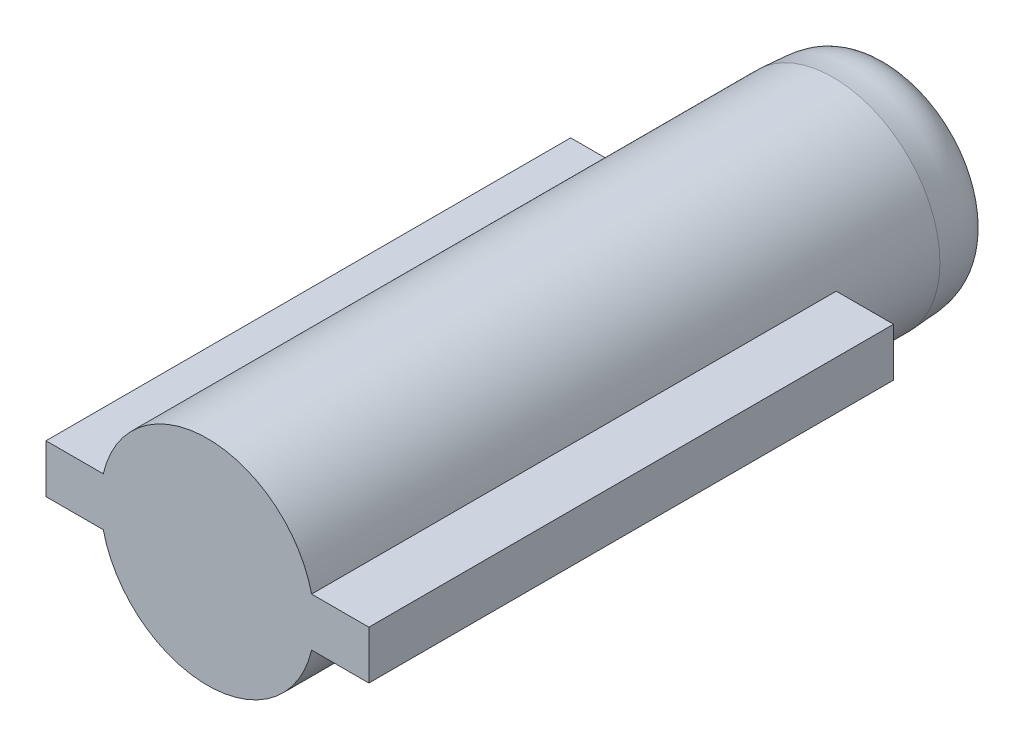
ISO-10303-21;
HEADER;
FILE_DESCRIPTION(('STEP AP214'),'2;1');
FILE_NAME('part.step','',(''),(''),'','','');
FILE_SCHEMA(('AUTOMOTIVE_DESIGN { 1 0 10303 214 1 1 1 1 }'));
ENDSEC;
DATA;
#1=APPLICATION_CONTEXT('core data for automotive mechanical design processes');
#2=APPLICATION_PROTOCOL_DEFINITION('international standard','automotive_design',2000,#1);
#3=PRODUCT_CONTEXT('',#1,'mechanical');
#4=PRODUCT('Part','Part','',(#3));
#5=PRODUCT_RELATED_PRODUCT_CATEGORY('part','',(#4));
#6=PRODUCT_DEFINITION_FORMATION('','',#4);
#7=PRODUCT_DEFINITION_CONTEXT('part definition',#1,'design');
#8=PRODUCT_DEFINITION('design','',#6,#7);
#9=PRODUCT_DEFINITION_SHAPE('','',#8);
#10=(LENGTH_UNIT() NAMED_UNIT(*) SI_UNIT(.MILLI.,.METRE.));
#11=(NAMED_UNIT(*) PLANE_ANGLE_UNIT() SI_UNIT($,.RADIAN.));
#12=(NAMED_UNIT(*) SI_UNIT($,.STERADIAN.) SOLID_ANGLE_UNIT());
#13=UNCERTAINTY_MEASURE_WITH_UNIT(LENGTH_MEASURE(1.E-05),#10,'distance_accuracy_value','');
#14=(GEOMETRIC_REPRESENTATION_CONTEXT(3) GLOBAL_UNCERTAINTY_ASSIGNED_CONTEXT((#13)) GLOBAL_UNIT_ASSIGNED_CONTEXT((#10,
#11,#12)) REPRESENTATION_CONTEXT('',''));
#15=CARTESIAN_POINT('',(0.,0.,0.));
#16=DIRECTION('',(0.,0.,1.));
#17=DIRECTION('',(1.,0.,0.));
#18=AXIS2_PLACEMENT_3D('',#15,#16,#17);
#19=CARTESIAN_POINT('',(0.,0.,17.));
#20=DIRECTION('',(0.,0.,-1.));
#21=DIRECTION('',(-1.,0.,0.));
#22=AXIS2_PLACEMENT_3D('',#19,#20,#21);
#23=CYLINDRICAL_SURFACE('',#22,2.65);
#24=CARTESIAN_POINT('',(0.,0.,1.50000000000001));
#25=DIRECTION('',(0.,0.,-1.));
#26=DIRECTION('',(-1.,0.,0.));
#27=AXIS2_PLACEMENT_3D('',#24,#25,#26);
#28=CIRCLE('',#27,2.65);
#29=CARTESIAN_POINT('',(-2.65,0.,1.50000000000001));
#30=VERTEX_POINT('',#29);
#31=EDGE_CURVE('E195',#30,#30,#28,.T.);
#32=ORIENTED_EDGE('',*,*,#31,.F.);
#33=EDGE_LOOP('',(#32));
#34=FACE_BOUND('',#33,.T.);
#35=CARTESIAN_POINT('',(0.,0.,4.));
#36=DIRECTION('',(0.,0.,1.));
#37=DIRECTION('',(1.,0.,0.));
#38=AXIS2_PLACEMENT_3D('',#35,#36,#37);
#39=CIRCLE('',#38,2.65);
#40=CARTESIAN_POINT('',(-2.58118189982806,0.6,4.));
#41=VERTEX_POINT('',#40);
#42=CARTESIAN_POINT('',(-2.58118189982806,-0.6,4.));
#43=VERTEX_POINT('',#42);
#44=EDGE_CURVE('E11',#41,#43,#39,.T.);
#45=ORIENTED_EDGE('',*,*,#44,.F.);
#46=DIRECTION('',(0.,0.,-1.));
#47=VECTOR('',#46,1.);
#48=CARTESIAN_POINT('',(-2.58118189982806,0.6,17.));
#49=LINE('',#48,#47);
#50=CARTESIAN_POINT('',(-2.58118189982806,0.6,17.));
#51=VERTEX_POINT('',#50);
#52=EDGE_CURVE('E150',#41,#51,#49,.F.);
#53=ORIENTED_EDGE('',*,*,#52,.T.);
#54=CARTESIAN_POINT('',(0.,0.,17.));
#55=DIRECTION('',(0.,0.,1.));
#56=DIRECTION('',(1.,0.,0.));
#57=AXIS2_PLACEMENT_3D('',#54,#55,#56);
#58=CIRCLE('',#57,2.65);
#59=CARTESIAN_POINT('',(2.58118189982806,0.6,17.));
#60=VERTEX_POINT('',#59);
#61=EDGE_CURVE('E156',#60,#51,#58,.T.);
#62=ORIENTED_EDGE('',*,*,#61,.F.);
#63=DIRECTION('',(0.,0.,-1.));
#64=VECTOR('',#63,1.);
#65=CARTESIAN_POINT('',(2.58118189982806,0.6,17.));
#66=LINE('',#65,#64);
#67=CARTESIAN_POINT('',(2.58118189982806,0.6,4.));
#68=VERTEX_POINT('',#67);
#69=EDGE_CURVE('E153',#60,#68,#66,.T.);
#70=ORIENTED_EDGE('',*,*,#69,.T.);
#71=CARTESIAN_POINT('',(2.58118189982806,-0.6,4.));
#72=VERTEX_POINT('',#71);
#73=EDGE_CURVE('E36',#72,#68,#39,.T.);
#74=ORIENTED_EDGE('',*,*,#73,.F.);
#75=DIRECTION('',(0.,0.,-1.));
#76=VECTOR('',#75,1.);
#77=CARTESIAN_POINT('',(2.58118189982806,-0.599999999999999,17.));
#78=LINE('',#77,#76);
#79=CARTESIAN_POINT('',(2.58118189982806,-0.6,17.));
#80=VERTEX_POINT('',#79);
#81=EDGE_CURVE('E141',#72,#80,#78,.F.);
#82=ORIENTED_EDGE('',*,*,#81,.T.);
#83=CARTESIAN_POINT('',(-2.58118189982806,-0.6,17.));
#84=VERTEX_POINT('',#83);
#85=EDGE_CURVE('E155',#84,#80,#58,.T.);
#86=ORIENTED_EDGE('',*,*,#85,.F.);
#87=DIRECTION('',(0.,0.,-1.));
#88=VECTOR('',#87,1.);
#89=CARTESIAN_POINT('',(-2.58118189982806,-0.6,17.));
#90=LINE('',#89,#88);
#91=EDGE_CURVE('E148',#84,#43,#90,.T.);
#92=ORIENTED_EDGE('',*,*,#91,.T.);
#93=EDGE_LOOP('',(#45,#53,#62,#70,#74,#82,#86,#92));
#94=FACE_BOUND('',#93,.T.);
#95=ADVANCED_FACE('F33',(#34,#94),#23,.T.);
#96=CARTESIAN_POINT('',(0.,0.,17.));
#97=DIRECTION('',(0.,0.,1.));
#98=DIRECTION('',(1.,0.,0.));
#99=AXIS2_PLACEMENT_3D('',#96,#97,#98);
#100=PLANE('',#99);
#101=ORIENTED_EDGE('',*,*,#85,.T.);
#102=DIRECTION('',(1.,0.,0.));
#103=VECTOR('',#102,1.);
#104=CARTESIAN_POINT('',(4.,-0.599999999999999,17.));
#105=LINE('',#104,#103);
#106=CARTESIAN_POINT('',(4.,-0.599999999999999,17.));
#107=VERTEX_POINT('',#106);
#108=EDGE_CURVE('E136',#80,#107,#105,.T.);
#109=ORIENTED_EDGE('',*,*,#108,.T.);
#110=DIRECTION('',(0.,1.,0.));
#111=VECTOR('',#110,1.);
#112=CARTESIAN_POINT('',(4.,-0.599999999999999,17.));
#113=LINE('',#112,#111);
#114=CARTESIAN_POINT('',(4.,0.600000000000001,17.));
#115=VERTEX_POINT('',#114);
#116=EDGE_CURVE('E138',#107,#115,#113,.T.);
#117=ORIENTED_EDGE('',*,*,#116,.T.);
#118=DIRECTION('',(-1.,0.,0.));
#119=VECTOR('',#118,1.);
#120=CARTESIAN_POINT('',(4.,0.600000000000001,17.));
#121=LINE('',#120,#119);
#122=EDGE_CURVE('E54',#115,#60,#121,.T.);
#123=ORIENTED_EDGE('',*,*,#122,.T.);
#124=ORIENTED_EDGE('',*,*,#61,.T.);
#125=CARTESIAN_POINT('',(-4.,0.6,17.));
#126=VERTEX_POINT('',#125);
#127=EDGE_CURVE('E123',#51,#126,#121,.T.);
#128=ORIENTED_EDGE('',*,*,#127,.T.);
#129=DIRECTION('',(0.,-1.,0.));
#130=VECTOR('',#129,1.);
#131=CARTESIAN_POINT('',(-4.,-0.6,17.));
#132=LINE('',#131,#130);
#133=CARTESIAN_POINT('',(-4.,-0.6,17.));
#134=VERTEX_POINT('',#133);
#135=EDGE_CURVE('E134',#126,#134,#132,.T.);
#136=ORIENTED_EDGE('',*,*,#135,.T.);
#137=EDGE_CURVE('E47',#134,#84,#105,.T.);
#138=ORIENTED_EDGE('',*,*,#137,.T.);
#139=EDGE_LOOP('',(#101,#109,#117,#123,#124,#128,#136,#138));
#140=FACE_BOUND('',#139,.T.);
#141=ADVANCED_FACE('F159',(#140),#100,.T.);
#142=CARTESIAN_POINT('',(4.,-0.599999999999999,4.));
#143=DIRECTION('',(1.,0.,0.));
#144=DIRECTION('',(0.,0.,-1.));
#145=AXIS2_PLACEMENT_3D('',#142,#143,#144);
#146=PLANE('',#145);
#147=ORIENTED_EDGE('',*,*,#116,.F.);
#148=DIRECTION('',(0.,0.,1.));
#149=VECTOR('',#148,1.);
#150=CARTESIAN_POINT('',(4.,-0.599999999999999,4.));
#151=LINE('',#150,#149);
#152=CARTESIAN_POINT('',(4.,-0.599999999999999,4.));
#153=VERTEX_POINT('',#152);
#154=EDGE_CURVE('E106',#153,#107,#151,.T.);
#155=ORIENTED_EDGE('',*,*,#154,.F.);
#156=DIRECTION('',(0.,1.,0.));
#157=VECTOR('',#156,1.);
#158=CARTESIAN_POINT('',(4.,-0.599999999999999,4.));
#159=LINE('',#158,#157);
#160=CARTESIAN_POINT('',(4.,0.600000000000001,4.));
#161=VERTEX_POINT('',#160);
#162=EDGE_CURVE('E115',#153,#161,#159,.T.);
#163=ORIENTED_EDGE('',*,*,#162,.T.);
#164=DIRECTION('',(0.,0.,1.));
#165=VECTOR('',#164,1.);
#166=CARTESIAN_POINT('',(4.,0.600000000000001,4.));
#167=LINE('',#166,#165);
#168=EDGE_CURVE('E142',#161,#115,#167,.T.);
#169=ORIENTED_EDGE('',*,*,#168,.T.);
#170=EDGE_LOOP('',(#147,#155,#163,#169));
#171=FACE_BOUND('',#170,.T.);
#172=ADVANCED_FACE('F172',(#171),#146,.T.);
#173=CARTESIAN_POINT('',(0.,0.,4.));
#174=DIRECTION('',(0.,0.,1.));
#175=DIRECTION('',(1.,0.,0.));
#176=AXIS2_PLACEMENT_3D('',#173,#174,#175);
#177=PLANE('',#176);
#178=DIRECTION('',(1.,0.,0.));
#179=VECTOR('',#178,1.);
#180=CARTESIAN_POINT('',(4.,-0.599999999999999,4.));
#181=LINE('',#180,#179);
#182=EDGE_CURVE('E116',#72,#153,#181,.T.);
#183=ORIENTED_EDGE('',*,*,#182,.F.);
#184=ORIENTED_EDGE('',*,*,#73,.T.);
#185=DIRECTION('',(-1.,0.,0.));
#186=VECTOR('',#185,1.);
#187=CARTESIAN_POINT('',(4.,0.600000000000001,4.));
#188=LINE('',#187,#186);
#189=EDGE_CURVE('E107',#161,#68,#188,.T.);
#190=ORIENTED_EDGE('',*,*,#189,.F.);
#191=ORIENTED_EDGE('',*,*,#162,.F.);
#192=EDGE_LOOP('',(#183,#184,#190,#191));
#193=FACE_BOUND('',#192,.T.);
#194=ADVANCED_FACE('F168',(#193),#177,.F.);
#195=CARTESIAN_POINT('',(4.,-0.599999999999999,4.));
#196=DIRECTION('',(0.,-1.,0.));
#197=DIRECTION('',(1.,0.,0.));
#198=AXIS2_PLACEMENT_3D('',#195,#196,#197);
#199=PLANE('',#198);
#200=ORIENTED_EDGE('',*,*,#81,.F.);
#201=ORIENTED_EDGE('',*,*,#182,.T.);
#202=ORIENTED_EDGE('',*,*,#154,.T.);
#203=ORIENTED_EDGE('',*,*,#108,.F.);
#204=EDGE_LOOP('',(#200,#201,#202,#203));
#205=FACE_BOUND('',#204,.T.);
#206=ADVANCED_FACE('F164',(#205),#199,.T.);
#207=CARTESIAN_POINT('',(4.,0.600000000000001,4.));
#208=DIRECTION('',(0.,1.,0.));
#209=DIRECTION('',(-1.,0.,0.));
#210=AXIS2_PLACEMENT_3D('',#207,#208,#209);
#211=PLANE('',#210);
#212=ORIENTED_EDGE('',*,*,#69,.F.);
#213=ORIENTED_EDGE('',*,*,#122,.F.);
#214=ORIENTED_EDGE('',*,*,#168,.F.);
#215=ORIENTED_EDGE('',*,*,#189,.T.);
#216=EDGE_LOOP('',(#212,#213,#214,#215));
#217=FACE_BOUND('',#216,.T.);
#218=ADVANCED_FACE('F174',(#217),#211,.T.);
#219=CARTESIAN_POINT('',(-4.,0.6,4.));
#220=VERTEX_POINT('',#219);
#221=EDGE_CURVE('E131',#41,#220,#188,.T.);
#222=ORIENTED_EDGE('',*,*,#221,.F.);
#223=ORIENTED_EDGE('',*,*,#44,.T.);
#224=CARTESIAN_POINT('',(-4.,-0.6,4.));
#225=VERTEX_POINT('',#224);
#226=EDGE_CURVE('E101',#225,#43,#181,.T.);
#227=ORIENTED_EDGE('',*,*,#226,.F.);
#228=DIRECTION('',(0.,-1.,0.));
#229=VECTOR('',#228,1.);
#230=CARTESIAN_POINT('',(-4.,-0.6,4.));
#231=LINE('',#230,#229);
#232=EDGE_CURVE('E113',#220,#225,#231,.T.);
#233=ORIENTED_EDGE('',*,*,#232,.F.);
#234=EDGE_LOOP('',(#222,#223,#227,#233));
#235=FACE_BOUND('',#234,.T.);
#236=ADVANCED_FACE('F112',(#235),#177,.F.);
#237=ORIENTED_EDGE('',*,*,#52,.F.);
#238=ORIENTED_EDGE('',*,*,#221,.T.);
#239=DIRECTION('',(0.,0.,1.));
#240=VECTOR('',#239,1.);
#241=CARTESIAN_POINT('',(-4.,0.6,4.));
#242=LINE('',#241,#240);
#243=EDGE_CURVE('E121',#220,#126,#242,.T.);
#244=ORIENTED_EDGE('',*,*,#243,.T.);
#245=ORIENTED_EDGE('',*,*,#127,.F.);
#246=EDGE_LOOP('',(#237,#238,#244,#245));
#247=FACE_BOUND('',#246,.T.);
#248=ADVANCED_FACE('F176',(#247),#211,.T.);
#249=ORIENTED_EDGE('',*,*,#91,.F.);
#250=ORIENTED_EDGE('',*,*,#137,.F.);
#251=DIRECTION('',(0.,0.,1.));
#252=VECTOR('',#251,1.);
#253=CARTESIAN_POINT('',(-4.,-0.6,4.));
#254=LINE('',#253,#252);
#255=EDGE_CURVE('E98',#225,#134,#254,.T.);
#256=ORIENTED_EDGE('',*,*,#255,.F.);
#257=ORIENTED_EDGE('',*,*,#226,.T.);
#258=EDGE_LOOP('',(#249,#250,#256,#257));
#259=FACE_BOUND('',#258,.T.);
#260=ADVANCED_FACE('F100',(#259),#199,.T.);
#261=CARTESIAN_POINT('',(-4.,-0.6,4.));
#262=DIRECTION('',(-1.,0.,0.));
#263=DIRECTION('',(0.,0.,1.));
#264=AXIS2_PLACEMENT_3D('',#261,#262,#263);
#265=PLANE('',#264);
#266=ORIENTED_EDGE('',*,*,#135,.F.);
#267=ORIENTED_EDGE('',*,*,#243,.F.);
#268=ORIENTED_EDGE('',*,*,#232,.T.);
#269=ORIENTED_EDGE('',*,*,#255,.T.);
#270=EDGE_LOOP('',(#266,#267,#268,#269));
#271=FACE_BOUND('',#270,.T.);
#272=ADVANCED_FACE('F119',(#271),#265,.T.);
#273=CARTESIAN_POINT('',(0.,2.65,1.50000000000001));
#274=CARTESIAN_POINT('',(0.,2.55537317860218,0.922815805737262));
#275=CARTESIAN_POINT('',(0.,2.84655662610956,-0.00317399949750963));
#276=CARTESIAN_POINT('',(0.,1.43187539710622,0.));
#277=B_SPLINE_CURVE_WITH_KNOTS('',3,(#273,#274,#275,#276),.UNSPECIFIED.,.F.,.F.,(4,4),(0.,
0.91074495904114),.UNSPECIFIED.);
#278=CARTESIAN_POINT('',(0.,0.,0.));
#279=DIRECTION('',(0.,0.,-1.));
#280=AXIS1_PLACEMENT('',#278,#279);
#281=SURFACE_OF_REVOLUTION('',#277,#280);
#282=CARTESIAN_POINT('',(0.,0.,0.));
#283=DIRECTION('',(0.,0.,-1.));
#284=DIRECTION('',(-1.,0.,0.));
#285=AXIS2_PLACEMENT_3D('',#282,#283,#284);
#286=CIRCLE('',#285,1.43187539710622);
#287=CARTESIAN_POINT('',(-1.43187539710622,0.,0.));
#288=VERTEX_POINT('',#287);
#289=EDGE_CURVE('E126',#288,#288,#286,.T.);
#290=ORIENTED_EDGE('',*,*,#289,.F.);
#291=EDGE_LOOP('',(#290));
#292=FACE_BOUND('',#291,.T.);
#293=ORIENTED_EDGE('',*,*,#31,.T.);
#294=EDGE_LOOP('',(#293));
#295=FACE_BOUND('',#294,.T.);
#296=ADVANCED_FACE('F206',(#292,#295),#281,.T.);
#297=CARTESIAN_POINT('',(0.,0.,0.));
#298=DIRECTION('',(0.,0.,1.));
#299=DIRECTION('',(1.,0.,0.));
#300=AXIS2_PLACEMENT_3D('',#297,#298,#299);
#301=PLANE('',#300);
#302=ORIENTED_EDGE('',*,*,#289,.T.);
#303=EDGE_LOOP('',(#302));
#304=FACE_BOUND('',#303,.T.);
#305=ADVANCED_FACE('F208',(#304),#301,.F.);
#306=CLOSED_SHELL('',(#95,#141,#172,#194,#206,#218,#236,#248,#260,#272,#296,#305));
#307=MANIFOLD_SOLID_BREP('B2',#306);
#308=ADVANCED_BREP_SHAPE_REPRESENTATION('',(#18,#307),#14);
#309=SHAPE_DEFINITION_REPRESENTATION(#9,#308);
ENDSEC;
END-ISO-10303-21;
